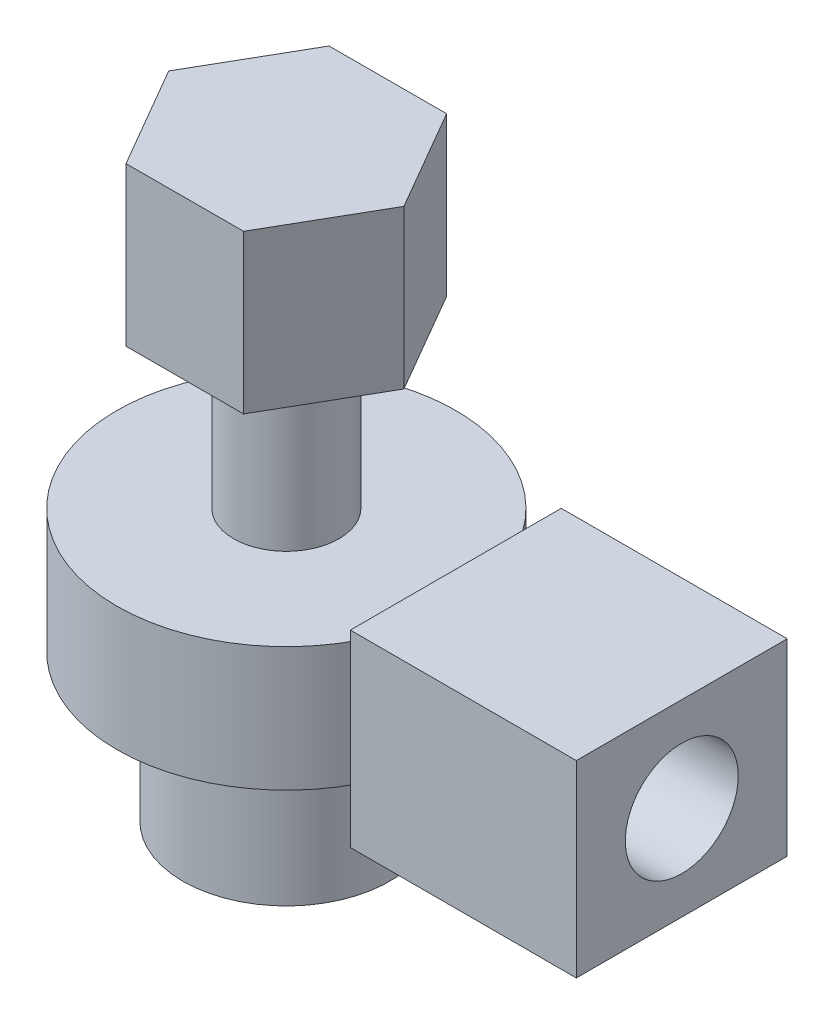
ISO-10303-21;
HEADER;
FILE_DESCRIPTION(('STEP AP214'),'2;1');
FILE_NAME('part.step','',(''),(''),'','','');
FILE_SCHEMA(('AUTOMOTIVE_DESIGN { 1 0 10303 214 1 1 1 1 }'));
ENDSEC;
DATA;
#1=APPLICATION_CONTEXT('core data for automotive mechanical design processes');
#2=APPLICATION_PROTOCOL_DEFINITION('international standard','automotive_design',2000,#1);
#3=PRODUCT_CONTEXT('',#1,'mechanical');
#4=PRODUCT('Part','Part','',(#3));
#5=PRODUCT_RELATED_PRODUCT_CATEGORY('part','',(#4));
#6=PRODUCT_DEFINITION_FORMATION('','',#4);
#7=PRODUCT_DEFINITION_CONTEXT('part definition',#1,'design');
#8=PRODUCT_DEFINITION('design','',#6,#7);
#9=PRODUCT_DEFINITION_SHAPE('','',#8);
#10=(LENGTH_UNIT() NAMED_UNIT(*) SI_UNIT(.MILLI.,.METRE.));
#11=(NAMED_UNIT(*) PLANE_ANGLE_UNIT() SI_UNIT($,.RADIAN.));
#12=(NAMED_UNIT(*) SI_UNIT($,.STERADIAN.) SOLID_ANGLE_UNIT());
#13=UNCERTAINTY_MEASURE_WITH_UNIT(LENGTH_MEASURE(1.E-05),#10,'distance_accuracy_value','');
#14=(GEOMETRIC_REPRESENTATION_CONTEXT(3) GLOBAL_UNCERTAINTY_ASSIGNED_CONTEXT((#13)) GLOBAL_UNIT_ASSIGNED_CONTEXT((#10,
#11,#12)) REPRESENTATION_CONTEXT('',''));
#15=CARTESIAN_POINT('',(0.,0.,0.));
#16=DIRECTION('',(0.,0.,1.));
#17=DIRECTION('',(1.,0.,0.));
#18=AXIS2_PLACEMENT_3D('',#15,#16,#17);
#19=CARTESIAN_POINT('',(10.5,3.05,-2.8));
#20=DIRECTION('',(0.,0.,1.));
#21=DIRECTION('',(1.,0.,0.));
#22=AXIS2_PLACEMENT_3D('',#19,#20,#21);
#23=PLANE('',#22);
#24=DIRECTION('',(0.,1.,0.));
#25=VECTOR('',#24,1.);
#26=CARTESIAN_POINT('',(4.5,3.05,-2.8));
#27=LINE('',#26,#25);
#28=CARTESIAN_POINT('',(4.5,3.05,-2.8));
#29=VERTEX_POINT('',#28);
#30=CARTESIAN_POINT('',(4.5,8.05,-2.8));
#31=VERTEX_POINT('',#30);
#32=EDGE_CURVE('E107',#29,#31,#27,.T.);
#33=ORIENTED_EDGE('',*,*,#32,.T.);
#34=DIRECTION('',(-1.,0.,0.));
#35=VECTOR('',#34,1.);
#36=CARTESIAN_POINT('',(10.5,8.05,-2.8));
#37=LINE('',#36,#35);
#38=CARTESIAN_POINT('',(10.5,8.05,-2.8));
#39=VERTEX_POINT('',#38);
#40=EDGE_CURVE('E12',#39,#31,#37,.T.);
#41=ORIENTED_EDGE('',*,*,#40,.F.);
#42=DIRECTION('',(0.,1.,0.));
#43=VECTOR('',#42,1.);
#44=CARTESIAN_POINT('',(10.5,3.05,-2.8));
#45=LINE('',#44,#43);
#46=CARTESIAN_POINT('',(10.5,3.05,-2.8));
#47=VERTEX_POINT('',#46);
#48=EDGE_CURVE('E95',#47,#39,#45,.T.);
#49=ORIENTED_EDGE('',*,*,#48,.F.);
#50=DIRECTION('',(-1.,0.,0.));
#51=VECTOR('',#50,1.);
#52=CARTESIAN_POINT('',(10.5,3.05,-2.8));
#53=LINE('',#52,#51);
#54=EDGE_CURVE('E103',#47,#29,#53,.T.);
#55=ORIENTED_EDGE('',*,*,#54,.T.);
#56=EDGE_LOOP('',(#33,#41,#49,#55));
#57=FACE_BOUND('',#56,.T.);
#58=ADVANCED_FACE('F44',(#57),#23,.F.);
#59=CARTESIAN_POINT('',(10.5,8.05,2.8));
#60=DIRECTION('',(0.,-1.,0.));
#61=DIRECTION('',(0.,0.,-1.));
#62=AXIS2_PLACEMENT_3D('',#59,#60,#61);
#63=PLANE('',#62);
#64=DIRECTION('',(0.,0.,1.));
#65=VECTOR('',#64,1.);
#66=CARTESIAN_POINT('',(4.5,8.05,2.8));
#67=LINE('',#66,#65);
#68=CARTESIAN_POINT('',(4.5,8.05,2.8));
#69=VERTEX_POINT('',#68);
#70=EDGE_CURVE('E99',#31,#69,#67,.T.);
#71=ORIENTED_EDGE('',*,*,#70,.T.);
#72=DIRECTION('',(-1.,0.,0.));
#73=VECTOR('',#72,1.);
#74=CARTESIAN_POINT('',(10.5,8.05,2.8));
#75=LINE('',#74,#73);
#76=CARTESIAN_POINT('',(10.5,8.05,2.8));
#77=VERTEX_POINT('',#76);
#78=EDGE_CURVE('E52',#77,#69,#75,.T.);
#79=ORIENTED_EDGE('',*,*,#78,.F.);
#80=DIRECTION('',(0.,0.,1.));
#81=VECTOR('',#80,1.);
#82=CARTESIAN_POINT('',(10.5,8.05,2.8));
#83=LINE('',#82,#81);
#84=EDGE_CURVE('E90',#39,#77,#83,.T.);
#85=ORIENTED_EDGE('',*,*,#84,.F.);
#86=ORIENTED_EDGE('',*,*,#40,.T.);
#87=EDGE_LOOP('',(#71,#79,#85,#86));
#88=FACE_BOUND('',#87,.T.);
#89=ADVANCED_FACE('F98',(#88),#63,.F.);
#90=CARTESIAN_POINT('',(10.5,3.05,2.8));
#91=DIRECTION('',(0.,0.,-1.));
#92=DIRECTION('',(-1.,0.,0.));
#93=AXIS2_PLACEMENT_3D('',#90,#91,#92);
#94=PLANE('',#93);
#95=DIRECTION('',(0.,-1.,0.));
#96=VECTOR('',#95,1.);
#97=CARTESIAN_POINT('',(4.5,3.05,2.8));
#98=LINE('',#97,#96);
#99=CARTESIAN_POINT('',(4.5,3.05,2.8));
#100=VERTEX_POINT('',#99);
#101=EDGE_CURVE('E77',#69,#100,#98,.T.);
#102=ORIENTED_EDGE('',*,*,#101,.T.);
#103=DIRECTION('',(-1.,0.,0.));
#104=VECTOR('',#103,1.);
#105=CARTESIAN_POINT('',(10.5,3.05,2.8));
#106=LINE('',#105,#104);
#107=CARTESIAN_POINT('',(10.5,3.05,2.8));
#108=VERTEX_POINT('',#107);
#109=EDGE_CURVE('E100',#108,#100,#106,.T.);
#110=ORIENTED_EDGE('',*,*,#109,.F.);
#111=DIRECTION('',(0.,-1.,0.));
#112=VECTOR('',#111,1.);
#113=CARTESIAN_POINT('',(10.5,3.05,2.8));
#114=LINE('',#113,#112);
#115=EDGE_CURVE('E93',#77,#108,#114,.T.);
#116=ORIENTED_EDGE('',*,*,#115,.F.);
#117=ORIENTED_EDGE('',*,*,#78,.T.);
#118=EDGE_LOOP('',(#102,#110,#116,#117));
#119=FACE_BOUND('',#118,.T.);
#120=ADVANCED_FACE('F101',(#119),#94,.F.);
#121=CARTESIAN_POINT('',(10.5,3.05,2.8));
#122=DIRECTION('',(0.,1.,0.));
#123=DIRECTION('',(0.,0.,1.));
#124=AXIS2_PLACEMENT_3D('',#121,#122,#123);
#125=PLANE('',#124);
#126=DIRECTION('',(0.,0.,-1.));
#127=VECTOR('',#126,1.);
#128=CARTESIAN_POINT('',(4.5,3.05,2.8));
#129=LINE('',#128,#127);
#130=EDGE_CURVE('E83',#100,#29,#129,.T.);
#131=ORIENTED_EDGE('',*,*,#130,.T.);
#132=ORIENTED_EDGE('',*,*,#54,.F.);
#133=DIRECTION('',(0.,0.,-1.));
#134=VECTOR('',#133,1.);
#135=CARTESIAN_POINT('',(10.5,3.05,2.8));
#136=LINE('',#135,#134);
#137=EDGE_CURVE('E60',#108,#47,#136,.T.);
#138=ORIENTED_EDGE('',*,*,#137,.F.);
#139=ORIENTED_EDGE('',*,*,#109,.T.);
#140=EDGE_LOOP('',(#131,#132,#138,#139));
#141=FACE_BOUND('',#140,.T.);
#142=ADVANCED_FACE('F115',(#141),#125,.F.);
#143=CARTESIAN_POINT('',(10.5,0.,0.));
#144=DIRECTION('',(-1.,0.,0.));
#145=DIRECTION('',(0.,0.,1.));
#146=AXIS2_PLACEMENT_3D('',#143,#144,#145);
#147=PLANE('',#146);
#148=CARTESIAN_POINT('',(10.5,5.55,0.));
#149=DIRECTION('',(1.,0.,0.));
#150=DIRECTION('',(0.,0.,-1.));
#151=AXIS2_PLACEMENT_3D('',#148,#149,#150);
#152=CIRCLE('',#151,1.5);
#153=CARTESIAN_POINT('',(10.5,5.55,-1.5));
#154=VERTEX_POINT('',#153);
#155=EDGE_CURVE('E121',#154,#154,#152,.T.);
#156=ORIENTED_EDGE('',*,*,#155,.F.);
#157=EDGE_LOOP('',(#156));
#158=FACE_BOUND('',#157,.T.);
#159=ORIENTED_EDGE('',*,*,#48,.T.);
#160=ORIENTED_EDGE('',*,*,#84,.T.);
#161=ORIENTED_EDGE('',*,*,#115,.T.);
#162=ORIENTED_EDGE('',*,*,#137,.T.);
#163=EDGE_LOOP('',(#159,#160,#161,#162));
#164=FACE_BOUND('',#163,.T.);
#165=ADVANCED_FACE('F91',(#158,#164),#147,.F.);
#166=CARTESIAN_POINT('',(4.5,0.,0.));
#167=DIRECTION('',(-1.,0.,0.));
#168=DIRECTION('',(0.,0.,1.));
#169=AXIS2_PLACEMENT_3D('',#166,#167,#168);
#170=PLANE('',#169);
#171=ORIENTED_EDGE('',*,*,#32,.F.);
#172=ORIENTED_EDGE('',*,*,#130,.F.);
#173=ORIENTED_EDGE('',*,*,#101,.F.);
#174=ORIENTED_EDGE('',*,*,#70,.F.);
#175=EDGE_LOOP('',(#171,#172,#173,#174));
#176=FACE_BOUND('',#175,.T.);
#177=ADVANCED_FACE('F118',(#176),#170,.T.);
#178=CARTESIAN_POINT('',(5.5,5.55,0.));
#179=DIRECTION('',(1.,0.,0.));
#180=DIRECTION('',(0.,0.,-1.));
#181=AXIS2_PLACEMENT_3D('',#178,#179,#180);
#182=CYLINDRICAL_SURFACE('',#181,1.5);
#183=CARTESIAN_POINT('',(5.5,5.55,0.));
#184=DIRECTION('',(1.,0.,0.));
#185=DIRECTION('',(0.,0.,-1.));
#186=AXIS2_PLACEMENT_3D('',#183,#184,#185);
#187=CIRCLE('',#186,1.5);
#188=CARTESIAN_POINT('',(5.5,5.55,-1.5));
#189=VERTEX_POINT('',#188);
#190=EDGE_CURVE('E110',#189,#189,#187,.T.);
#191=ORIENTED_EDGE('',*,*,#190,.F.);
#192=EDGE_LOOP('',(#191));
#193=FACE_BOUND('',#192,.T.);
#194=ORIENTED_EDGE('',*,*,#155,.T.);
#195=EDGE_LOOP('',(#194));
#196=FACE_BOUND('',#195,.T.);
#197=ADVANCED_FACE('F129',(#193,#196),#182,.F.);
#198=CARTESIAN_POINT('',(5.5,5.55,0.));
#199=DIRECTION('',(1.,0.,0.));
#200=DIRECTION('',(0.,0.,-1.));
#201=AXIS2_PLACEMENT_3D('',#198,#199,#200);
#202=PLANE('',#201);
#203=ORIENTED_EDGE('',*,*,#190,.T.);
#204=EDGE_LOOP('',(#203));
#205=FACE_BOUND('',#204,.T.);
#206=ADVANCED_FACE('F127',(#205),#202,.T.);
#207=CLOSED_SHELL('',(#58,#89,#120,#142,#165,#177,#197,#206));
#208=MANIFOLD_SOLID_BREP('B2',#207);
#209=CARTESIAN_POINT('',(0.,11.5,0.));
#210=DIRECTION('',(0.,-1.,0.));
#211=DIRECTION('',(0.,0.,-1.));
#212=AXIS2_PLACEMENT_3D('',#209,#210,#211);
#213=CYLINDRICAL_SURFACE('',#212,1.4);
#214=CARTESIAN_POINT('',(0.,7.2,0.));
#215=DIRECTION('',(0.,1.,0.));
#216=DIRECTION('',(0.,0.,1.));
#217=AXIS2_PLACEMENT_3D('',#214,#215,#216);
#218=CIRCLE('',#217,1.4);
#219=CARTESIAN_POINT('',(0.,7.2,1.4));
#220=VERTEX_POINT('',#219);
#221=EDGE_CURVE('E201',#220,#220,#218,.T.);
#222=ORIENTED_EDGE('',*,*,#221,.T.);
#223=EDGE_LOOP('',(#222));
#224=FACE_BOUND('',#223,.T.);
#225=CARTESIAN_POINT('',(0.,11.5,0.));
#226=DIRECTION('',(0.,1.,0.));
#227=DIRECTION('',(0.,0.,1.));
#228=AXIS2_PLACEMENT_3D('',#225,#226,#227);
#229=CIRCLE('',#228,1.4);
#230=CARTESIAN_POINT('',(0.,11.5,1.4));
#231=VERTEX_POINT('',#230);
#232=EDGE_CURVE('E303',#231,#231,#229,.T.);
#233=ORIENTED_EDGE('',*,*,#232,.F.);
#234=EDGE_LOOP('',(#233));
#235=FACE_BOUND('',#234,.T.);
#236=ADVANCED_FACE('F197',(#224,#235),#213,.T.);
#237=CARTESIAN_POINT('',(3.11768769196028,15.7,-0.00484307747237343));
#238=DIRECTION('',(-0.865247649966082,0.,0.501344696020784));
#239=DIRECTION('',(0.501344696020784,0.,0.865247649966082));
#240=AXIS2_PLACEMENT_3D('',#237,#238,#239);
#241=PLANE('',#240);
#242=DIRECTION('',(-0.501344696020784,0.,-0.865247649966082));
#243=VECTOR('',#242,1.);
#244=CARTESIAN_POINT('',(3.11768769196028,11.5,-0.00484307747237343));
#245=LINE('',#244,#243);
#246=CARTESIAN_POINT('',(3.11768769196028,11.5,-0.00484307747237343));
#247=VERTEX_POINT('',#246);
#248=CARTESIAN_POINT('',(1.55464961785657,11.5,-2.70241828103986));
#249=VERTEX_POINT('',#248);
#250=EDGE_CURVE('E284',#247,#249,#245,.T.);
#251=ORIENTED_EDGE('',*,*,#250,.T.);
#252=DIRECTION('',(0.,-1.,0.));
#253=VECTOR('',#252,1.);
#254=CARTESIAN_POINT('',(1.55464961785657,15.7,-2.70241828103986));
#255=LINE('',#254,#253);
#256=CARTESIAN_POINT('',(1.55464961785657,15.7,-2.70241828103986));
#257=VERTEX_POINT('',#256);
#258=EDGE_CURVE('E301',#257,#249,#255,.T.);
#259=ORIENTED_EDGE('',*,*,#258,.F.);
#260=DIRECTION('',(-0.501344696020784,0.,-0.865247649966082));
#261=VECTOR('',#260,1.);
#262=CARTESIAN_POINT('',(3.11768769196028,15.7,-0.00484307747237343));
#263=LINE('',#262,#261);
#264=CARTESIAN_POINT('',(3.11768769196028,15.7,-0.00484307747237343));
#265=VERTEX_POINT('',#264);
#266=EDGE_CURVE('E294',#265,#257,#263,.T.);
#267=ORIENTED_EDGE('',*,*,#266,.F.);
#268=DIRECTION('',(0.,-1.,0.));
#269=VECTOR('',#268,1.);
#270=CARTESIAN_POINT('',(3.11768769196028,15.7,-0.00484307747237343));
#271=LINE('',#270,#269);
#272=EDGE_CURVE('E280',#265,#247,#271,.T.);
#273=ORIENTED_EDGE('',*,*,#272,.T.);
#274=EDGE_LOOP('',(#251,#259,#267,#273));
#275=FACE_BOUND('',#274,.T.);
#276=ADVANCED_FACE('F330',(#275),#241,.F.);
#277=CARTESIAN_POINT('',(1.55464961785657,15.7,-2.70241828103986));
#278=DIRECTION('',(0.0015534178235452,0.,0.999998793445805));
#279=DIRECTION('',(0.999998793445805,0.,-0.0015534178235452));
#280=AXIS2_PLACEMENT_3D('',#277,#278,#279);
#281=PLANE('',#280);
#282=DIRECTION('',(-0.999998793445805,0.,0.0015534178235452));
#283=VECTOR('',#282,1.);
#284=CARTESIAN_POINT('',(1.55464961785657,11.5,-2.70241828103986));
#285=LINE('',#284,#283);
#286=CARTESIAN_POINT('',(-1.56303807410371,11.5,-2.69757520356749));
#287=VERTEX_POINT('',#286);
#288=EDGE_CURVE('E287',#249,#287,#285,.T.);
#289=ORIENTED_EDGE('',*,*,#288,.T.);
#290=DIRECTION('',(0.,-1.,0.));
#291=VECTOR('',#290,1.);
#292=CARTESIAN_POINT('',(-1.56303807410371,15.7,-2.69757520356749));
#293=LINE('',#292,#291);
#294=CARTESIAN_POINT('',(-1.56303807410371,15.7,-2.69757520356749));
#295=VERTEX_POINT('',#294);
#296=EDGE_CURVE('E298',#295,#287,#293,.T.);
#297=ORIENTED_EDGE('',*,*,#296,.F.);
#298=DIRECTION('',(-0.999998793445805,0.,0.0015534178235452));
#299=VECTOR('',#298,1.);
#300=CARTESIAN_POINT('',(1.55464961785657,15.7,-2.70241828103986));
#301=LINE('',#300,#299);
#302=EDGE_CURVE('E253',#257,#295,#301,.T.);
#303=ORIENTED_EDGE('',*,*,#302,.F.);
#304=ORIENTED_EDGE('',*,*,#258,.T.);
#305=EDGE_LOOP('',(#289,#297,#303,#304));
#306=FACE_BOUND('',#305,.T.);
#307=ADVANCED_FACE('F337',(#306),#281,.F.);
#308=CARTESIAN_POINT('',(-1.56303807410371,15.7,-2.69757520356749));
#309=DIRECTION('',(0.866801067789627,0.,0.498654097425021));
#310=DIRECTION('',(0.498654097425021,0.,-0.866801067789627));
#311=AXIS2_PLACEMENT_3D('',#308,#309,#310);
#312=PLANE('',#311);
#313=DIRECTION('',(-0.498654097425021,0.,0.866801067789627));
#314=VECTOR('',#313,1.);
#315=CARTESIAN_POINT('',(-1.56303807410371,11.5,-2.69757520356749));
#316=LINE('',#315,#314);
#317=CARTESIAN_POINT('',(-3.11768769196028,11.5,0.00484307747237395));
#318=VERTEX_POINT('',#317);
#319=EDGE_CURVE('E289',#287,#318,#316,.T.);
#320=ORIENTED_EDGE('',*,*,#319,.T.);
#321=DIRECTION('',(0.,-1.,0.));
#322=VECTOR('',#321,1.);
#323=CARTESIAN_POINT('',(-3.11768769196028,15.7,0.00484307747237395));
#324=LINE('',#323,#322);
#325=CARTESIAN_POINT('',(-3.11768769196028,15.7,0.00484307747237395));
#326=VERTEX_POINT('',#325);
#327=EDGE_CURVE('E275',#326,#318,#324,.T.);
#328=ORIENTED_EDGE('',*,*,#327,.F.);
#329=DIRECTION('',(-0.498654097425021,0.,0.866801067789627));
#330=VECTOR('',#329,1.);
#331=CARTESIAN_POINT('',(-1.56303807410371,15.7,-2.69757520356749));
#332=LINE('',#331,#330);
#333=EDGE_CURVE('E266',#295,#326,#332,.T.);
#334=ORIENTED_EDGE('',*,*,#333,.F.);
#335=ORIENTED_EDGE('',*,*,#296,.T.);
#336=EDGE_LOOP('',(#320,#328,#334,#335));
#337=FACE_BOUND('',#336,.T.);
#338=ADVANCED_FACE('F366',(#337),#312,.F.);
#339=CARTESIAN_POINT('',(-3.11768769196028,15.7,0.00484307747237395));
#340=DIRECTION('',(0.865247649966082,0.,-0.501344696020784));
#341=DIRECTION('',(-0.501344696020784,0.,-0.865247649966082));
#342=AXIS2_PLACEMENT_3D('',#339,#340,#341);
#343=PLANE('',#342);
#344=DIRECTION('',(0.501344696020784,0.,0.865247649966082));
#345=VECTOR('',#344,1.);
#346=CARTESIAN_POINT('',(-3.11768769196028,11.5,0.00484307747237395));
#347=LINE('',#346,#345);
#348=CARTESIAN_POINT('',(-1.55464961785657,11.5,2.70241828103986));
#349=VERTEX_POINT('',#348);
#350=EDGE_CURVE('E274',#318,#349,#347,.T.);
#351=ORIENTED_EDGE('',*,*,#350,.T.);
#352=DIRECTION('',(0.,-1.,0.));
#353=VECTOR('',#352,1.);
#354=CARTESIAN_POINT('',(-1.55464961785657,15.7,2.70241828103986));
#355=LINE('',#354,#353);
#356=CARTESIAN_POINT('',(-1.55464961785657,15.7,2.70241828103986));
#357=VERTEX_POINT('',#356);
#358=EDGE_CURVE('E271',#357,#349,#355,.T.);
#359=ORIENTED_EDGE('',*,*,#358,.F.);
#360=DIRECTION('',(0.501344696020784,0.,0.865247649966082));
#361=VECTOR('',#360,1.);
#362=CARTESIAN_POINT('',(-3.11768769196028,15.7,0.00484307747237395));
#363=LINE('',#362,#361);
#364=EDGE_CURVE('E260',#326,#357,#363,.T.);
#365=ORIENTED_EDGE('',*,*,#364,.F.);
#366=ORIENTED_EDGE('',*,*,#327,.T.);
#367=EDGE_LOOP('',(#351,#359,#365,#366));
#368=FACE_BOUND('',#367,.T.);
#369=ADVANCED_FACE('F272',(#368),#343,.F.);
#370=CARTESIAN_POINT('',(-1.55464961785657,15.7,2.70241828103986));
#371=DIRECTION('',(-0.00155341782354492,0.,-0.999998793445805));
#372=DIRECTION('',(-0.999998793445805,0.,0.00155341782354492));
#373=AXIS2_PLACEMENT_3D('',#370,#371,#372);
#374=PLANE('',#373);
#375=DIRECTION('',(0.999998793445805,0.,-0.00155341782354492));
#376=VECTOR('',#375,1.);
#377=CARTESIAN_POINT('',(-1.55464961785657,11.5,2.70241828103986));
#378=LINE('',#377,#376);
#379=CARTESIAN_POINT('',(1.56303807410371,11.5,2.69757520356749));
#380=VERTEX_POINT('',#379);
#381=EDGE_CURVE('E238',#349,#380,#378,.T.);
#382=ORIENTED_EDGE('',*,*,#381,.T.);
#383=DIRECTION('',(0.,-1.,0.));
#384=VECTOR('',#383,1.);
#385=CARTESIAN_POINT('',(1.56303807410371,15.7,2.69757520356749));
#386=LINE('',#385,#384);
#387=CARTESIAN_POINT('',(1.56303807410371,15.7,2.69757520356749));
#388=VERTEX_POINT('',#387);
#389=EDGE_CURVE('E276',#388,#380,#386,.T.);
#390=ORIENTED_EDGE('',*,*,#389,.F.);
#391=DIRECTION('',(0.999998793445805,0.,-0.00155341782354492));
#392=VECTOR('',#391,1.);
#393=CARTESIAN_POINT('',(-1.55464961785657,15.7,2.70241828103986));
#394=LINE('',#393,#392);
#395=EDGE_CURVE('E264',#357,#388,#394,.T.);
#396=ORIENTED_EDGE('',*,*,#395,.F.);
#397=ORIENTED_EDGE('',*,*,#358,.T.);
#398=EDGE_LOOP('',(#382,#390,#396,#397));
#399=FACE_BOUND('',#398,.T.);
#400=ADVANCED_FACE('F278',(#399),#374,.F.);
#401=CARTESIAN_POINT('',(1.56303807410371,15.7,2.69757520356749));
#402=DIRECTION('',(-0.866801067789627,0.,-0.498654097425021));
#403=DIRECTION('',(-0.498654097425021,0.,0.866801067789627));
#404=AXIS2_PLACEMENT_3D('',#401,#402,#403);
#405=PLANE('',#404);
#406=DIRECTION('',(0.498654097425021,0.,-0.866801067789627));
#407=VECTOR('',#406,1.);
#408=CARTESIAN_POINT('',(1.56303807410371,11.5,2.69757520356749));
#409=LINE('',#408,#407);
#410=EDGE_CURVE('E244',#380,#247,#409,.T.);
#411=ORIENTED_EDGE('',*,*,#410,.T.);
#412=ORIENTED_EDGE('',*,*,#272,.F.);
#413=DIRECTION('',(0.498654097425021,0.,-0.866801067789627));
#414=VECTOR('',#413,1.);
#415=CARTESIAN_POINT('',(1.56303807410371,15.7,2.69757520356749));
#416=LINE('',#415,#414);
#417=EDGE_CURVE('E215',#388,#265,#416,.T.);
#418=ORIENTED_EDGE('',*,*,#417,.F.);
#419=ORIENTED_EDGE('',*,*,#389,.T.);
#420=EDGE_LOOP('',(#411,#412,#418,#419));
#421=FACE_BOUND('',#420,.T.);
#422=ADVANCED_FACE('F370',(#421),#405,.F.);
#423=CARTESIAN_POINT('',(0.,15.7,0.));
#424=DIRECTION('',(0.,1.,0.));
#425=DIRECTION('',(0.,0.,1.));
#426=AXIS2_PLACEMENT_3D('',#423,#424,#425);
#427=PLANE('',#426);
#428=ORIENTED_EDGE('',*,*,#266,.T.);
#429=ORIENTED_EDGE('',*,*,#302,.T.);
#430=ORIENTED_EDGE('',*,*,#333,.T.);
#431=ORIENTED_EDGE('',*,*,#364,.T.);
#432=ORIENTED_EDGE('',*,*,#395,.T.);
#433=ORIENTED_EDGE('',*,*,#417,.T.);
#434=EDGE_LOOP('',(#428,#429,#430,#431,#432,#433));
#435=FACE_BOUND('',#434,.T.);
#436=ADVANCED_FACE('F262',(#435),#427,.T.);
#437=CARTESIAN_POINT('',(0.,11.5,0.));
#438=DIRECTION('',(0.,1.,0.));
#439=DIRECTION('',(0.,0.,1.));
#440=AXIS2_PLACEMENT_3D('',#437,#438,#439);
#441=PLANE('',#440);
#442=ORIENTED_EDGE('',*,*,#232,.T.);
#443=EDGE_LOOP('',(#442));
#444=FACE_BOUND('',#443,.T.);
#445=ORIENTED_EDGE('',*,*,#250,.F.);
#446=ORIENTED_EDGE('',*,*,#410,.F.);
#447=ORIENTED_EDGE('',*,*,#381,.F.);
#448=ORIENTED_EDGE('',*,*,#350,.F.);
#449=ORIENTED_EDGE('',*,*,#319,.F.);
#450=ORIENTED_EDGE('',*,*,#288,.F.);
#451=EDGE_LOOP('',(#445,#446,#447,#448,#449,#450));
#452=FACE_BOUND('',#451,.T.);
#453=ADVANCED_FACE('F369',(#444,#452),#441,.F.);
#454=CARTESIAN_POINT('',(0.,7.2,0.));
#455=DIRECTION('',(0.,-1.,0.));
#456=DIRECTION('',(0.,0.,-1.));
#457=AXIS2_PLACEMENT_3D('',#454,#455,#456);
#458=CYLINDRICAL_SURFACE('',#457,4.5);
#459=CARTESIAN_POINT('',(0.,3.9,0.));
#460=DIRECTION('',(0.,1.,0.));
#461=DIRECTION('',(0.,0.,1.));
#462=AXIS2_PLACEMENT_3D('',#459,#460,#461);
#463=CIRCLE('',#462,4.5);
#464=CARTESIAN_POINT('',(0.,3.9,4.5));
#465=VERTEX_POINT('',#464);
#466=EDGE_CURVE('E354',#465,#465,#463,.T.);
#467=ORIENTED_EDGE('',*,*,#466,.T.);
#468=EDGE_LOOP('',(#467));
#469=FACE_BOUND('',#468,.T.);
#470=CARTESIAN_POINT('',(0.,7.2,0.));
#471=DIRECTION('',(0.,1.,0.));
#472=DIRECTION('',(0.,0.,1.));
#473=AXIS2_PLACEMENT_3D('',#470,#471,#472);
#474=CIRCLE('',#473,4.5);
#475=CARTESIAN_POINT('',(0.,7.2,4.5));
#476=VERTEX_POINT('',#475);
#477=EDGE_CURVE('E356',#476,#476,#474,.T.);
#478=ORIENTED_EDGE('',*,*,#477,.F.);
#479=EDGE_LOOP('',(#478));
#480=FACE_BOUND('',#479,.T.);
#481=ADVANCED_FACE('F420',(#469,#480),#458,.T.);
#482=CARTESIAN_POINT('',(0.,7.2,0.));
#483=DIRECTION('',(0.,1.,0.));
#484=DIRECTION('',(0.,0.,1.));
#485=AXIS2_PLACEMENT_3D('',#482,#483,#484);
#486=PLANE('',#485);
#487=ORIENTED_EDGE('',*,*,#221,.F.);
#488=EDGE_LOOP('',(#487));
#489=FACE_BOUND('',#488,.T.);
#490=ORIENTED_EDGE('',*,*,#477,.T.);
#491=EDGE_LOOP('',(#490));
#492=FACE_BOUND('',#491,.T.);
#493=ADVANCED_FACE('F325',(#489,#492),#486,.T.);
#494=CARTESIAN_POINT('',(0.,3.9,0.));
#495=DIRECTION('',(0.,1.,0.));
#496=DIRECTION('',(0.,0.,1.));
#497=AXIS2_PLACEMENT_3D('',#494,#495,#496);
#498=PLANE('',#497);
#499=CARTESIAN_POINT('',(0.,3.9,0.));
#500=DIRECTION('',(0.,1.,0.));
#501=DIRECTION('',(0.,0.,1.));
#502=AXIS2_PLACEMENT_3D('',#499,#500,#501);
#503=CIRCLE('',#502,1.4);
#504=CARTESIAN_POINT('',(0.,3.9,1.4));
#505=VERTEX_POINT('',#504);
#506=EDGE_CURVE('E42',#505,#505,#503,.T.);
#507=ORIENTED_EDGE('',*,*,#506,.T.);
#508=EDGE_LOOP('',(#507));
#509=FACE_BOUND('',#508,.T.);
#510=ORIENTED_EDGE('',*,*,#466,.F.);
#511=EDGE_LOOP('',(#510));
#512=FACE_BOUND('',#511,.T.);
#513=ADVANCED_FACE('F318',(#509,#512),#498,.F.);
#514=CARTESIAN_POINT('',(0.,0.,0.));
#515=DIRECTION('',(0.,1.,0.));
#516=DIRECTION('',(0.,0.,1.));
#517=AXIS2_PLACEMENT_3D('',#514,#515,#516);
#518=PLANE('',#517);
#519=CARTESIAN_POINT('',(0.,0.,0.));
#520=DIRECTION('',(0.,1.,0.));
#521=DIRECTION('',(0.,0.,1.));
#522=AXIS2_PLACEMENT_3D('',#519,#520,#521);
#523=CIRCLE('',#522,2.75);
#524=CARTESIAN_POINT('',(0.,0.,2.75));
#525=VERTEX_POINT('',#524);
#526=EDGE_CURVE('E306',#525,#525,#523,.T.);
#527=ORIENTED_EDGE('',*,*,#526,.F.);
#528=EDGE_LOOP('',(#527));
#529=FACE_BOUND('',#528,.T.);
#530=ADVANCED_FACE('F316',(#529),#518,.F.);
#531=CARTESIAN_POINT('',(0.,3.2,0.));
#532=DIRECTION('',(0.,-1.,0.));
#533=DIRECTION('',(0.,0.,-1.));
#534=AXIS2_PLACEMENT_3D('',#531,#532,#533);
#535=CYLINDRICAL_SURFACE('',#534,2.75);
#536=CARTESIAN_POINT('',(0.,3.2,0.));
#537=DIRECTION('',(0.,1.,0.));
#538=DIRECTION('',(0.,0.,1.));
#539=AXIS2_PLACEMENT_3D('',#536,#537,#538);
#540=CIRCLE('',#539,2.75);
#541=CARTESIAN_POINT('',(0.,3.2,2.75));
#542=VERTEX_POINT('',#541);
#543=EDGE_CURVE('E309',#542,#542,#540,.T.);
#544=ORIENTED_EDGE('',*,*,#543,.F.);
#545=EDGE_LOOP('',(#544));
#546=FACE_BOUND('',#545,.T.);
#547=ORIENTED_EDGE('',*,*,#526,.T.);
#548=EDGE_LOOP('',(#547));
#549=FACE_BOUND('',#548,.T.);
#550=ADVANCED_FACE('F199',(#546,#549),#535,.T.);
#551=CARTESIAN_POINT('',(0.,3.2,0.));
#552=DIRECTION('',(0.,1.,0.));
#553=DIRECTION('',(0.,0.,1.));
#554=AXIS2_PLACEMENT_3D('',#551,#552,#553);
#555=PLANE('',#554);
#556=CARTESIAN_POINT('',(0.,3.2,0.));
#557=DIRECTION('',(0.,1.,0.));
#558=DIRECTION('',(0.,0.,1.));
#559=AXIS2_PLACEMENT_3D('',#556,#557,#558);
#560=CIRCLE('',#559,1.4);
#561=CARTESIAN_POINT('',(0.,3.2,1.4));
#562=VERTEX_POINT('',#561);
#563=EDGE_CURVE('E207',#562,#562,#560,.T.);
#564=ORIENTED_EDGE('',*,*,#563,.F.);
#565=EDGE_LOOP('',(#564));
#566=FACE_BOUND('',#565,.T.);
#567=ORIENTED_EDGE('',*,*,#543,.T.);
#568=EDGE_LOOP('',(#567));
#569=FACE_BOUND('',#568,.T.);
#570=ADVANCED_FACE('F323',(#566,#569),#555,.T.);
#571=ORIENTED_EDGE('',*,*,#563,.T.);
#572=EDGE_LOOP('',(#571));
#573=FACE_BOUND('',#572,.T.);
#574=ORIENTED_EDGE('',*,*,#506,.F.);
#575=EDGE_LOOP('',(#574));
#576=FACE_BOUND('',#575,.T.);
#577=ADVANCED_FACE('F333',(#573,#576),#213,.T.);
#578=CLOSED_SHELL('',(#236,#276,#307,#338,#369,#400,#422,#436,#453,#481,#493,#513,#530,#550,
#570,#577));
#579=MANIFOLD_SOLID_BREP('B6',#578);
#580=ADVANCED_BREP_SHAPE_REPRESENTATION('',(#18,#208,#579),#14);
#581=SHAPE_DEFINITION_REPRESENTATION(#9,#580);
ENDSEC;
END-ISO-10303-21;
